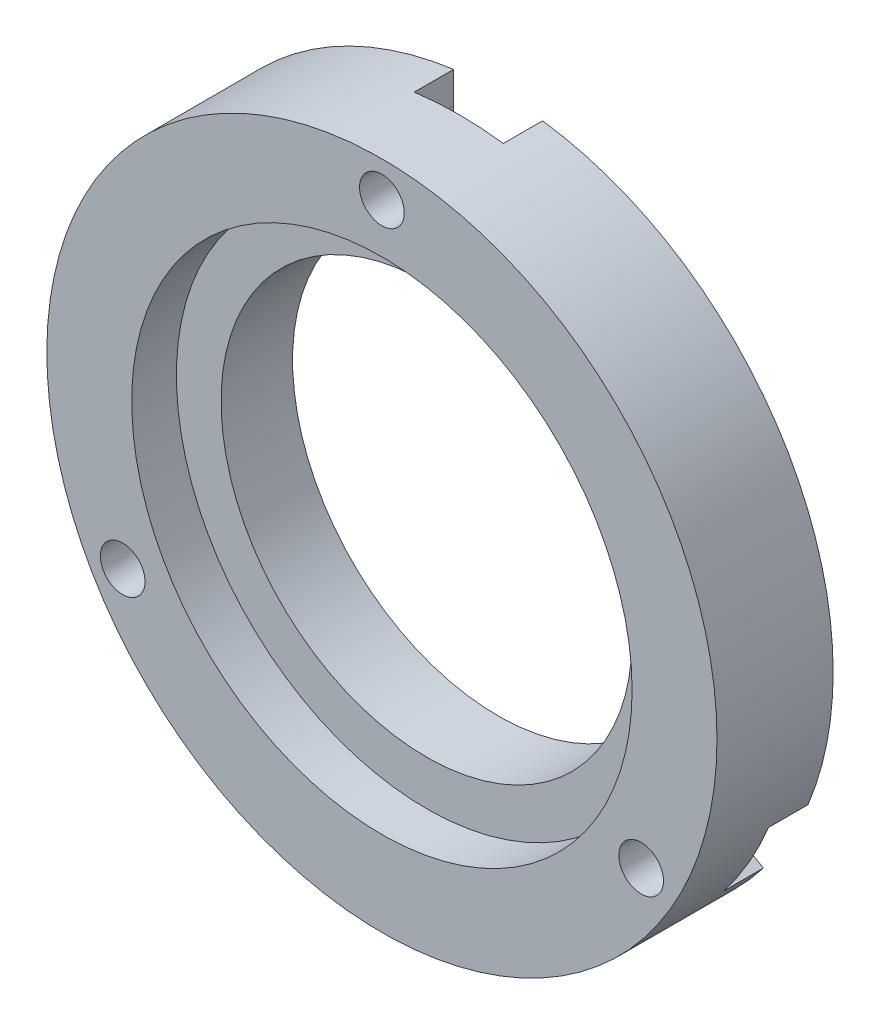
ISO-10303-21;
HEADER;
FILE_DESCRIPTION(('STEP AP214'),'2;1');
FILE_NAME('part.step','',(''),(''),'','','');
FILE_SCHEMA(('AUTOMOTIVE_DESIGN { 1 0 10303 214 1 1 1 1 }'));
ENDSEC;
DATA;
#1=APPLICATION_CONTEXT('core data for automotive mechanical design processes');
#2=APPLICATION_PROTOCOL_DEFINITION('international standard','automotive_design',2000,#1);
#3=PRODUCT_CONTEXT('',#1,'mechanical');
#4=PRODUCT('Part','Part','',(#3));
#5=PRODUCT_RELATED_PRODUCT_CATEGORY('part','',(#4));
#6=PRODUCT_DEFINITION_FORMATION('','',#4);
#7=PRODUCT_DEFINITION_CONTEXT('part definition',#1,'design');
#8=PRODUCT_DEFINITION('design','',#6,#7);
#9=PRODUCT_DEFINITION_SHAPE('','',#8);
#10=(LENGTH_UNIT() NAMED_UNIT(*) SI_UNIT(.MILLI.,.METRE.));
#11=(NAMED_UNIT(*) PLANE_ANGLE_UNIT() SI_UNIT($,.RADIAN.));
#12=(NAMED_UNIT(*) SI_UNIT($,.STERADIAN.) SOLID_ANGLE_UNIT());
#13=UNCERTAINTY_MEASURE_WITH_UNIT(LENGTH_MEASURE(1.E-05),#10,'distance_accuracy_value','');
#14=(GEOMETRIC_REPRESENTATION_CONTEXT(3) GLOBAL_UNCERTAINTY_ASSIGNED_CONTEXT((#13)) GLOBAL_UNIT_ASSIGNED_CONTEXT((#10,
#11,#12)) REPRESENTATION_CONTEXT('',''));
#15=CARTESIAN_POINT('',(0.,0.,0.));
#16=DIRECTION('',(0.,0.,1.));
#17=DIRECTION('',(1.,0.,0.));
#18=AXIS2_PLACEMENT_3D('',#15,#16,#17);
#19=CARTESIAN_POINT('',(14.5059255133883,-8.37500000000063,6.5));
#20=DIRECTION('',(0.,0.,-1.));
#21=DIRECTION('',(-1.,0.,0.));
#22=AXIS2_PLACEMENT_3D('',#19,#20,#21);
#23=CYLINDRICAL_SURFACE('',#22,1.25000000000135);
#24=CARTESIAN_POINT('',(14.5059255133883,-8.37500000000063,6.5));
#25=DIRECTION('',(0.,0.,1.));
#26=DIRECTION('',(1.,0.,0.));
#27=AXIS2_PLACEMENT_3D('',#24,#25,#26);
#28=CIRCLE('',#27,1.25000000000135);
#29=CARTESIAN_POINT('',(15.7559255133896,-8.37500000000063,6.5));
#30=VERTEX_POINT('',#29);
#31=EDGE_CURVE('E51',#30,#30,#28,.T.);
#32=ORIENTED_EDGE('',*,*,#31,.T.);
#33=EDGE_LOOP('',(#32));
#34=FACE_BOUND('',#33,.T.);
#35=CARTESIAN_POINT('',(14.5059255133883,-8.37500000000063,2.2));
#36=DIRECTION('',(0.,0.,-1.));
#37=DIRECTION('',(-1.,0.,0.));
#38=AXIS2_PLACEMENT_3D('',#35,#36,#37);
#39=CIRCLE('',#38,1.25000000000135);
#40=CARTESIAN_POINT('',(13.2559255133869,-8.37500000000063,2.2));
#41=VERTEX_POINT('',#40);
#42=EDGE_CURVE('E174',#41,#41,#39,.T.);
#43=ORIENTED_EDGE('',*,*,#42,.T.);
#44=EDGE_LOOP('',(#43));
#45=FACE_BOUND('',#44,.T.);
#46=ADVANCED_FACE('F41',(#34,#45),#23,.F.);
#47=CARTESIAN_POINT('',(-14.5059255133904,-8.37499999999937,6.5));
#48=DIRECTION('',(0.,0.,-1.));
#49=DIRECTION('',(-1.,0.,0.));
#50=AXIS2_PLACEMENT_3D('',#47,#48,#49);
#51=CYLINDRICAL_SURFACE('',#50,1.25000000000093);
#52=CARTESIAN_POINT('',(-14.5059255133904,-8.37499999999937,6.5));
#53=DIRECTION('',(0.,0.,1.));
#54=DIRECTION('',(1.,0.,0.));
#55=AXIS2_PLACEMENT_3D('',#52,#53,#54);
#56=CIRCLE('',#55,1.25000000000093);
#57=CARTESIAN_POINT('',(-13.2559255133895,-8.37499999999937,6.5));
#58=VERTEX_POINT('',#57);
#59=EDGE_CURVE('E195',#58,#58,#56,.T.);
#60=ORIENTED_EDGE('',*,*,#59,.T.);
#61=EDGE_LOOP('',(#60));
#62=FACE_BOUND('',#61,.T.);
#63=CARTESIAN_POINT('',(-14.5059255133904,-8.37499999999937,2.2));
#64=DIRECTION('',(0.,0.,-1.));
#65=DIRECTION('',(-1.,0.,0.));
#66=AXIS2_PLACEMENT_3D('',#63,#64,#65);
#67=CIRCLE('',#66,1.25000000000093);
#68=CARTESIAN_POINT('',(-15.7559255133914,-8.37499999999937,2.2));
#69=VERTEX_POINT('',#68);
#70=EDGE_CURVE('E179',#69,#69,#67,.T.);
#71=ORIENTED_EDGE('',*,*,#70,.T.);
#72=EDGE_LOOP('',(#71));
#73=FACE_BOUND('',#72,.T.);
#74=ADVANCED_FACE('F329',(#62,#73),#51,.F.);
#75=CARTESIAN_POINT('',(0.,16.75,6.5));
#76=DIRECTION('',(0.,0.,-1.));
#77=DIRECTION('',(-1.,0.,0.));
#78=AXIS2_PLACEMENT_3D('',#75,#76,#77);
#79=CYLINDRICAL_SURFACE('',#78,1.25);
#80=CARTESIAN_POINT('',(0.,16.75,6.5));
#81=DIRECTION('',(0.,0.,1.));
#82=DIRECTION('',(1.,0.,0.));
#83=AXIS2_PLACEMENT_3D('',#80,#81,#82);
#84=CIRCLE('',#83,1.25);
#85=CARTESIAN_POINT('',(1.25,16.75,6.5));
#86=VERTEX_POINT('',#85);
#87=EDGE_CURVE('E191',#86,#86,#84,.T.);
#88=ORIENTED_EDGE('',*,*,#87,.T.);
#89=EDGE_LOOP('',(#88));
#90=FACE_BOUND('',#89,.T.);
#91=CARTESIAN_POINT('',(0.,16.75,2.2));
#92=DIRECTION('',(0.,0.,-1.));
#93=DIRECTION('',(-1.,0.,0.));
#94=AXIS2_PLACEMENT_3D('',#91,#92,#93);
#95=CIRCLE('',#94,1.25);
#96=CARTESIAN_POINT('',(-1.25,16.75,2.2));
#97=VERTEX_POINT('',#96);
#98=EDGE_CURVE('E170',#97,#97,#95,.T.);
#99=ORIENTED_EDGE('',*,*,#98,.T.);
#100=EDGE_LOOP('',(#99));
#101=FACE_BOUND('',#100,.T.);
#102=ADVANCED_FACE('F336',(#90,#101),#79,.F.);
#103=CARTESIAN_POINT('',(0.,0.,6.5));
#104=DIRECTION('',(0.,0.,-1.));
#105=DIRECTION('',(-1.,0.,0.));
#106=AXIS2_PLACEMENT_3D('',#103,#104,#105);
#107=CYLINDRICAL_SURFACE('',#106,11.5);
#108=CARTESIAN_POINT('',(0.,0.,0.));
#109=DIRECTION('',(0.,0.,1.));
#110=DIRECTION('',(1.,0.,0.));
#111=AXIS2_PLACEMENT_3D('',#108,#109,#110);
#112=CIRCLE('',#111,11.5);
#113=CARTESIAN_POINT('',(11.5,0.,0.));
#114=VERTEX_POINT('',#113);
#115=EDGE_CURVE('E203',#114,#114,#112,.T.);
#116=ORIENTED_EDGE('',*,*,#115,.F.);
#117=EDGE_LOOP('',(#116));
#118=FACE_BOUND('',#117,.T.);
#119=CARTESIAN_POINT('',(0.,0.,4.));
#120=DIRECTION('',(0.,0.,1.));
#121=DIRECTION('',(1.,0.,0.));
#122=AXIS2_PLACEMENT_3D('',#119,#120,#121);
#123=CIRCLE('',#122,11.5);
#124=CARTESIAN_POINT('',(11.5,0.,4.));
#125=VERTEX_POINT('',#124);
#126=EDGE_CURVE('E45',#125,#125,#123,.T.);
#127=ORIENTED_EDGE('',*,*,#126,.T.);
#128=EDGE_LOOP('',(#127));
#129=FACE_BOUND('',#128,.T.);
#130=ADVANCED_FACE('F43',(#118,#129),#107,.F.);
#131=CARTESIAN_POINT('',(0.,0.,6.5));
#132=DIRECTION('',(0.,0.,-1.));
#133=DIRECTION('',(-1.,0.,0.));
#134=AXIS2_PLACEMENT_3D('',#131,#132,#133);
#135=CYLINDRICAL_SURFACE('',#134,18.75);
#136=CARTESIAN_POINT('',(0.,0.,0.));
#137=DIRECTION('',(0.,0.,1.));
#138=DIRECTION('',(1.,0.,0.));
#139=AXIS2_PLACEMENT_3D('',#136,#137,#138);
#140=CIRCLE('',#139,18.75);
#141=CARTESIAN_POINT('',(17.3390168270808,-7.13589486120757,0.));
#142=VERTEX_POINT('',#141);
#143=CARTESIAN_POINT('',(2.49151525396037,18.5837254537211,0.));
#144=VERTEX_POINT('',#143);
#145=EDGE_CURVE('E206',#142,#144,#140,.T.);
#146=ORIENTED_EDGE('',*,*,#145,.T.);
#147=DIRECTION('',(0.,0.,-1.));
#148=VECTOR('',#147,1.);
#149=CARTESIAN_POINT('',(2.49151525396037,18.5837254537211,2.2));
#150=LINE('',#149,#148);
#151=CARTESIAN_POINT('',(2.49151525396037,18.5837254537211,2.2));
#152=VERTEX_POINT('',#151);
#153=EDGE_CURVE('E241',#152,#144,#150,.T.);
#154=ORIENTED_EDGE('',*,*,#153,.F.);
#155=CARTESIAN_POINT('',(0.,0.,2.2));
#156=DIRECTION('',(0.,0.,-1.));
#157=DIRECTION('',(-1.,0.,0.));
#158=AXIS2_PLACEMENT_3D('',#155,#156,#157);
#159=CIRCLE('',#158,18.75);
#160=CARTESIAN_POINT('',(-2.48964218499991,18.5839764795016,2.2));
#161=VERTEX_POINT('',#160);
#162=EDGE_CURVE('E158',#161,#152,#159,.T.);
#163=ORIENTED_EDGE('',*,*,#162,.F.);
#164=DIRECTION('',(0.,0.,-1.));
#165=VECTOR('',#164,1.);
#166=CARTESIAN_POINT('',(-2.48964218499991,18.5839764795016,2.2));
#167=LINE('',#166,#165);
#168=CARTESIAN_POINT('',(-2.48964218499991,18.5839764795016,0.));
#169=VERTEX_POINT('',#168);
#170=EDGE_CURVE('E141',#161,#169,#167,.T.);
#171=ORIENTED_EDGE('',*,*,#170,.T.);
#172=CARTESIAN_POINT('',(-17.3397359668583,-7.1341472230143,0.));
#173=VERTEX_POINT('',#172);
#174=EDGE_CURVE('E196',#169,#173,#140,.T.);
#175=ORIENTED_EDGE('',*,*,#174,.T.);
#176=DIRECTION('',(0.,0.,-1.));
#177=VECTOR('',#176,1.);
#178=CARTESIAN_POINT('',(-17.3397359668583,-7.1341472230143,2.2));
#179=LINE('',#178,#177);
#180=CARTESIAN_POINT('',(-17.3397359668583,-7.1341472230143,2.2));
#181=VERTEX_POINT('',#180);
#182=EDGE_CURVE('E222',#181,#173,#179,.T.);
#183=ORIENTED_EDGE('',*,*,#182,.F.);
#184=CARTESIAN_POINT('',(0.,0.,2.2));
#185=DIRECTION('',(0.,0.,-1.));
#186=DIRECTION('',(-1.,0.,0.));
#187=AXIS2_PLACEMENT_3D('',#184,#185,#186);
#188=CIRCLE('',#187,18.75);
#189=CARTESIAN_POINT('',(-14.849374642081,-11.448081618294,2.2));
#190=VERTEX_POINT('',#189);
#191=EDGE_CURVE('E294',#190,#181,#188,.T.);
#192=ORIENTED_EDGE('',*,*,#191,.F.);
#193=DIRECTION('',(0.,0.,-1.));
#194=VECTOR('',#193,1.);
#195=CARTESIAN_POINT('',(-14.849374642081,-11.448081618294,2.2));
#196=LINE('',#195,#194);
#197=CARTESIAN_POINT('',(-14.849374642081,-11.448081618294,0.));
#198=VERTEX_POINT('',#197);
#199=EDGE_CURVE('E265',#190,#198,#196,.T.);
#200=ORIENTED_EDGE('',*,*,#199,.T.);
#201=CARTESIAN_POINT('',(14.8482207128978,-11.4495782307068,0.));
#202=VERTEX_POINT('',#201);
#203=EDGE_CURVE('E209',#198,#202,#140,.T.);
#204=ORIENTED_EDGE('',*,*,#203,.T.);
#205=DIRECTION('',(0.,0.,-1.));
#206=VECTOR('',#205,1.);
#207=CARTESIAN_POINT('',(14.8482207128978,-11.4495782307068,2.2));
#208=LINE('',#207,#206);
#209=CARTESIAN_POINT('',(14.8482207128978,-11.4495782307068,2.2));
#210=VERTEX_POINT('',#209);
#211=EDGE_CURVE('E286',#210,#202,#208,.T.);
#212=ORIENTED_EDGE('',*,*,#211,.F.);
#213=CARTESIAN_POINT('',(0.,0.,2.2));
#214=DIRECTION('',(0.,0.,-1.));
#215=DIRECTION('',(-1.,0.,0.));
#216=AXIS2_PLACEMENT_3D('',#213,#214,#215);
#217=CIRCLE('',#216,18.75);
#218=CARTESIAN_POINT('',(17.3390168270808,-7.13589486120757,2.2));
#219=VERTEX_POINT('',#218);
#220=EDGE_CURVE('E163',#219,#210,#217,.T.);
#221=ORIENTED_EDGE('',*,*,#220,.F.);
#222=DIRECTION('',(0.,0.,-1.));
#223=VECTOR('',#222,1.);
#224=CARTESIAN_POINT('',(17.3390168270808,-7.13589486120757,2.2));
#225=LINE('',#224,#223);
#226=EDGE_CURVE('E266',#219,#142,#225,.T.);
#227=ORIENTED_EDGE('',*,*,#226,.T.);
#228=EDGE_LOOP('',(#146,#154,#163,#171,#175,#183,#192,#200,#204,#212,#221,#227));
#229=FACE_BOUND('',#228,.T.);
#230=CARTESIAN_POINT('',(0.,0.,6.5));
#231=DIRECTION('',(0.,0.,1.));
#232=DIRECTION('',(1.,0.,0.));
#233=AXIS2_PLACEMENT_3D('',#230,#231,#232);
#234=CIRCLE('',#233,18.75);
#235=CARTESIAN_POINT('',(18.75,0.,6.5));
#236=VERTEX_POINT('',#235);
#237=EDGE_CURVE('E12',#236,#236,#234,.T.);
#238=ORIENTED_EDGE('',*,*,#237,.F.);
#239=EDGE_LOOP('',(#238));
#240=FACE_BOUND('',#239,.T.);
#241=ADVANCED_FACE('F220',(#229,#240),#135,.T.);
#242=CARTESIAN_POINT('',(0.,0.,6.5));
#243=DIRECTION('',(0.,0.,1.));
#244=DIRECTION('',(1.,0.,0.));
#245=AXIS2_PLACEMENT_3D('',#242,#243,#244);
#246=PLANE('',#245);
#247=CARTESIAN_POINT('',(0.,0.,6.5));
#248=DIRECTION('',(0.,0.,1.));
#249=DIRECTION('',(1.,0.,0.));
#250=AXIS2_PLACEMENT_3D('',#247,#248,#249);
#251=CIRCLE('',#250,14.);
#252=CARTESIAN_POINT('',(14.,0.,6.5));
#253=VERTEX_POINT('',#252);
#254=EDGE_CURVE('E183',#253,#253,#251,.T.);
#255=ORIENTED_EDGE('',*,*,#254,.F.);
#256=EDGE_LOOP('',(#255));
#257=FACE_BOUND('',#256,.T.);
#258=ORIENTED_EDGE('',*,*,#87,.F.);
#259=EDGE_LOOP('',(#258));
#260=FACE_BOUND('',#259,.T.);
#261=ORIENTED_EDGE('',*,*,#59,.F.);
#262=EDGE_LOOP('',(#261));
#263=FACE_BOUND('',#262,.T.);
#264=ORIENTED_EDGE('',*,*,#31,.F.);
#265=EDGE_LOOP('',(#264));
#266=FACE_BOUND('',#265,.T.);
#267=ORIENTED_EDGE('',*,*,#237,.T.);
#268=EDGE_LOOP('',(#267));
#269=FACE_BOUND('',#268,.T.);
#270=ADVANCED_FACE('F371',(#257,#260,#263,#266,#269),#246,.T.);
#271=CARTESIAN_POINT('',(0.,0.,0.));
#272=DIRECTION('',(0.,0.,1.));
#273=DIRECTION('',(1.,0.,0.));
#274=AXIS2_PLACEMENT_3D('',#271,#272,#273);
#275=PLANE('',#274);
#276=ORIENTED_EDGE('',*,*,#115,.T.);
#277=EDGE_LOOP('',(#276));
#278=FACE_BOUND('',#277,.T.);
#279=CARTESIAN_POINT('',(9.27209697909603E-13,16.7500000000006,0.));
#280=DIRECTION('',(0.,0.,-1.));
#281=DIRECTION('',(-1.,0.,0.));
#282=AXIS2_PLACEMENT_3D('',#279,#280,#281);
#283=CIRCLE('',#282,2.5);
#284=CARTESIAN_POINT('',(2.49851367155371,16.8361941591057,0.));
#285=VERTEX_POINT('',#284);
#286=CARTESIAN_POINT('',(-2.4991238908121,16.8161798939832,0.));
#287=VERTEX_POINT('',#286);
#288=EDGE_CURVE('E152',#285,#287,#283,.T.);
#289=ORIENTED_EDGE('',*,*,#288,.F.);
#290=DIRECTION('',(0.00400471310317549,-0.999991981104329,0.));
#291=VECTOR('',#290,1.);
#292=CARTESIAN_POINT('',(2.56589718776298,0.0102757644895189,0.));
#293=LINE('',#292,#291);
#294=EDGE_CURVE('E252',#144,#285,#293,.T.);
#295=ORIENTED_EDGE('',*,*,#294,.F.);
#296=ORIENTED_EDGE('',*,*,#145,.F.);
#297=DIRECTION('',(0.863331199318094,-0.504637731728396,0.));
#298=VECTOR('',#297,1.);
#299=CARTESIAN_POINT('',(1.30664911939185,2.23540746243613,0.));
#300=LINE('',#299,#298);
#301=CARTESIAN_POINT('',(15.8128009282046,-6.24378517034379,0.));
#302=VERTEX_POINT('',#301);
#303=EDGE_CURVE('E262',#302,#142,#300,.T.);
#304=ORIENTED_EDGE('',*,*,#303,.F.);
#305=CARTESIAN_POINT('',(14.5059255133894,-8.37500000000118,0.));
#306=DIRECTION('',(0.,0.,-1.));
#307=DIRECTION('',(-1.,0.,0.));
#308=AXIS2_PLACEMENT_3D('',#305,#306,#307);
#309=CIRCLE('',#308,2.5);
#310=CARTESIAN_POINT('',(13.3313150090558,-10.5818733908212,0.));
#311=VERTEX_POINT('',#310);
#312=EDGE_CURVE('E157',#311,#302,#309,.T.);
#313=ORIENTED_EDGE('',*,*,#312,.F.);
#314=DIRECTION('',(-0.868020815768663,0.49652780726995,0.));
#315=VECTOR('',#314,1.);
#316=CARTESIAN_POINT('',(-1.27404952079027,-2.22727003034654,0.));
#317=LINE('',#316,#315);
#318=EDGE_CURVE('E269',#202,#311,#317,.T.);
#319=ORIENTED_EDGE('',*,*,#318,.F.);
#320=ORIENTED_EDGE('',*,*,#203,.F.);
#321=DIRECTION('',(-0.868694695043998,-0.495347884624953,0.));
#322=VECTOR('',#321,1.);
#323=CARTESIAN_POINT('',(1.28259509058306,-2.24929506244399,0.));
#324=LINE('',#323,#322);
#325=CARTESIAN_POINT('',(-13.3136770373926,-10.5723947236394,0.));
#326=VERTEX_POINT('',#325);
#327=EDGE_CURVE('E247',#326,#198,#324,.T.);
#328=ORIENTED_EDGE('',*,*,#327,.F.);
#329=CARTESIAN_POINT('',(-14.5059255133904,-8.37499999999937,0.));
#330=DIRECTION('',(0.,0.,-1.));
#331=DIRECTION('',(-1.,0.,0.));
#332=AXIS2_PLACEMENT_3D('',#329,#330,#331);
#333=CIRCLE('',#332,2.5);
#334=CARTESIAN_POINT('',(-15.8298286806096,-6.25432076828444,0.));
#335=VERTEX_POINT('',#334);
#336=EDGE_CURVE('E230',#335,#326,#333,.T.);
#337=ORIENTED_EDGE('',*,*,#336,.F.);
#338=DIRECTION('',(0.864016102665493,0.503464173834377,0.));
#339=VECTOR('',#338,1.);
#340=CARTESIAN_POINT('',(-1.29184766697273,2.21699426585708,0.));
#341=LINE('',#340,#339);
#342=EDGE_CURVE('E227',#173,#335,#341,.T.);
#343=ORIENTED_EDGE('',*,*,#342,.F.);
#344=ORIENTED_EDGE('',*,*,#174,.F.);
#345=DIRECTION('',(0.00536349572589624,0.999985616353354,0.));
#346=VECTOR('',#345,1.);
#347=CARTESIAN_POINT('',(-2.58924420997492,0.0138876000078334,0.));
#348=LINE('',#347,#346);
#349=EDGE_CURVE('E143',#287,#169,#348,.T.);
#350=ORIENTED_EDGE('',*,*,#349,.F.);
#351=EDGE_LOOP('',(#289,#295,#296,#304,#313,#319,#320,#328,#337,#343,#344,#350));
#352=FACE_BOUND('',#351,.T.);
#353=ADVANCED_FACE('F225',(#278,#352),#275,.F.);
#354=CARTESIAN_POINT('',(0.,0.,4.));
#355=DIRECTION('',(0.,0.,1.));
#356=DIRECTION('',(1.,0.,0.));
#357=AXIS2_PLACEMENT_3D('',#354,#355,#356);
#358=CYLINDRICAL_SURFACE('',#357,14.);
#359=CARTESIAN_POINT('',(0.,0.,4.));
#360=DIRECTION('',(0.,0.,1.));
#361=DIRECTION('',(1.,0.,0.));
#362=AXIS2_PLACEMENT_3D('',#359,#360,#361);
#363=CIRCLE('',#362,14.);
#364=CARTESIAN_POINT('',(14.,0.,4.));
#365=VERTEX_POINT('',#364);
#366=EDGE_CURVE('E184',#365,#365,#363,.T.);
#367=ORIENTED_EDGE('',*,*,#366,.F.);
#368=EDGE_LOOP('',(#367));
#369=FACE_BOUND('',#368,.T.);
#370=ORIENTED_EDGE('',*,*,#254,.T.);
#371=EDGE_LOOP('',(#370));
#372=FACE_BOUND('',#371,.T.);
#373=ADVANCED_FACE('F366',(#369,#372),#358,.F.);
#374=CARTESIAN_POINT('',(0.,0.,4.));
#375=DIRECTION('',(0.,0.,1.));
#376=DIRECTION('',(1.,0.,0.));
#377=AXIS2_PLACEMENT_3D('',#374,#375,#376);
#378=PLANE('',#377);
#379=ORIENTED_EDGE('',*,*,#126,.F.);
#380=EDGE_LOOP('',(#379));
#381=FACE_BOUND('',#380,.T.);
#382=ORIENTED_EDGE('',*,*,#366,.T.);
#383=EDGE_LOOP('',(#382));
#384=FACE_BOUND('',#383,.T.);
#385=ADVANCED_FACE('F360',(#381,#384),#378,.T.);
#386=CARTESIAN_POINT('',(9.27209697909603E-13,16.7500000000006,2.2));
#387=DIRECTION('',(0.,0.,-1.));
#388=DIRECTION('',(-1.,0.,0.));
#389=AXIS2_PLACEMENT_3D('',#386,#387,#388);
#390=CYLINDRICAL_SURFACE('',#389,2.5);
#391=CARTESIAN_POINT('',(9.27209697909603E-13,16.7500000000006,2.2));
#392=DIRECTION('',(0.,0.,-1.));
#393=DIRECTION('',(-1.,0.,0.));
#394=AXIS2_PLACEMENT_3D('',#391,#392,#393);
#395=CIRCLE('',#394,2.5);
#396=CARTESIAN_POINT('',(2.49851367155371,16.8361941591057,2.2));
#397=VERTEX_POINT('',#396);
#398=CARTESIAN_POINT('',(-2.4991238908121,16.8161798939832,2.2));
#399=VERTEX_POINT('',#398);
#400=EDGE_CURVE('E150',#397,#399,#395,.T.);
#401=ORIENTED_EDGE('',*,*,#400,.F.);
#402=DIRECTION('',(0.,0.,-1.));
#403=VECTOR('',#402,1.);
#404=CARTESIAN_POINT('',(2.49851367155371,16.8361941591057,2.2));
#405=LINE('',#404,#403);
#406=EDGE_CURVE('E236',#397,#285,#405,.T.);
#407=ORIENTED_EDGE('',*,*,#406,.T.);
#408=ORIENTED_EDGE('',*,*,#288,.T.);
#409=DIRECTION('',(0.,0.,-1.));
#410=VECTOR('',#409,1.);
#411=CARTESIAN_POINT('',(-2.4991238908121,16.8161798939832,2.2));
#412=LINE('',#411,#410);
#413=EDGE_CURVE('E138',#399,#287,#412,.T.);
#414=ORIENTED_EDGE('',*,*,#413,.F.);
#415=EDGE_LOOP('',(#401,#407,#408,#414));
#416=FACE_BOUND('',#415,.T.);
#417=ADVANCED_FACE('F148',(#416),#390,.F.);
#418=CARTESIAN_POINT('',(4.63604848954802E-13,8.37500000000031,2.2));
#419=DIRECTION('',(0.,0.,-1.));
#420=DIRECTION('',(-1.,0.,0.));
#421=AXIS2_PLACEMENT_3D('',#418,#419,#420);
#422=PLANE('',#421);
#423=ORIENTED_EDGE('',*,*,#98,.F.);
#424=EDGE_LOOP('',(#423));
#425=FACE_BOUND('',#424,.T.);
#426=ORIENTED_EDGE('',*,*,#162,.T.);
#427=DIRECTION('',(0.00400471310317549,-0.999991981104329,0.));
#428=VECTOR('',#427,1.);
#429=CARTESIAN_POINT('',(2.56589718776298,0.0102757644895189,2.2));
#430=LINE('',#429,#428);
#431=EDGE_CURVE('E59',#152,#397,#430,.T.);
#432=ORIENTED_EDGE('',*,*,#431,.T.);
#433=ORIENTED_EDGE('',*,*,#400,.T.);
#434=DIRECTION('',(0.00536349572589624,0.999985616353354,0.));
#435=VECTOR('',#434,1.);
#436=CARTESIAN_POINT('',(-2.58924420997492,0.0138876000078334,2.2));
#437=LINE('',#436,#435);
#438=EDGE_CURVE('E135',#399,#161,#437,.T.);
#439=ORIENTED_EDGE('',*,*,#438,.T.);
#440=EDGE_LOOP('',(#426,#432,#433,#439));
#441=FACE_BOUND('',#440,.T.);
#442=ADVANCED_FACE('F155',(#425,#441),#422,.T.);
#443=CARTESIAN_POINT('',(14.5059255133894,-8.37500000000118,2.2));
#444=DIRECTION('',(0.,0.,-1.));
#445=DIRECTION('',(-1.,0.,0.));
#446=AXIS2_PLACEMENT_3D('',#443,#444,#445);
#447=CYLINDRICAL_SURFACE('',#446,2.5);
#448=ORIENTED_EDGE('',*,*,#312,.T.);
#449=DIRECTION('',(0.,0.,-1.));
#450=VECTOR('',#449,1.);
#451=CARTESIAN_POINT('',(15.8128009282046,-6.24378517034379,2.2));
#452=LINE('',#451,#450);
#453=CARTESIAN_POINT('',(15.8128009282046,-6.24378517034379,2.2));
#454=VERTEX_POINT('',#453);
#455=EDGE_CURVE('E261',#454,#302,#452,.T.);
#456=ORIENTED_EDGE('',*,*,#455,.F.);
#457=CARTESIAN_POINT('',(14.5059255133894,-8.37500000000118,2.2));
#458=DIRECTION('',(0.,0.,-1.));
#459=DIRECTION('',(-1.,0.,0.));
#460=AXIS2_PLACEMENT_3D('',#457,#458,#459);
#461=CIRCLE('',#460,2.5);
#462=CARTESIAN_POINT('',(13.3313150090559,-10.5818733908212,2.2));
#463=VERTEX_POINT('',#462);
#464=EDGE_CURVE('E302',#463,#454,#461,.T.);
#465=ORIENTED_EDGE('',*,*,#464,.F.);
#466=DIRECTION('',(0.,0.,-1.));
#467=VECTOR('',#466,1.);
#468=CARTESIAN_POINT('',(13.3313150090558,-10.5818733908212,2.2));
#469=LINE('',#468,#467);
#470=EDGE_CURVE('E169',#463,#311,#469,.T.);
#471=ORIENTED_EDGE('',*,*,#470,.T.);
#472=EDGE_LOOP('',(#448,#456,#465,#471));
#473=FACE_BOUND('',#472,.T.);
#474=ADVANCED_FACE('F310',(#473),#447,.F.);
#475=CARTESIAN_POINT('',(7.25296275669469,-4.18750000000059,2.2));
#476=DIRECTION('',(0.,0.,-1.));
#477=DIRECTION('',(-1.,0.,0.));
#478=AXIS2_PLACEMENT_3D('',#475,#476,#477);
#479=PLANE('',#478);
#480=ORIENTED_EDGE('',*,*,#42,.F.);
#481=EDGE_LOOP('',(#480));
#482=FACE_BOUND('',#481,.T.);
#483=ORIENTED_EDGE('',*,*,#220,.T.);
#484=DIRECTION('',(-0.868020815768663,0.49652780726995,0.));
#485=VECTOR('',#484,1.);
#486=CARTESIAN_POINT('',(-1.27404952079027,-2.22727003034654,2.2));
#487=LINE('',#486,#485);
#488=EDGE_CURVE('E67',#210,#463,#487,.T.);
#489=ORIENTED_EDGE('',*,*,#488,.T.);
#490=ORIENTED_EDGE('',*,*,#464,.T.);
#491=DIRECTION('',(0.863331199318094,-0.504637731728396,0.));
#492=VECTOR('',#491,1.);
#493=CARTESIAN_POINT('',(1.30664911939185,2.23540746243613,2.2));
#494=LINE('',#493,#492);
#495=EDGE_CURVE('E257',#454,#219,#494,.T.);
#496=ORIENTED_EDGE('',*,*,#495,.T.);
#497=EDGE_LOOP('',(#483,#489,#490,#496));
#498=FACE_BOUND('',#497,.T.);
#499=ADVANCED_FACE('F307',(#482,#498),#479,.T.);
#500=CARTESIAN_POINT('',(-14.5059255133904,-8.37499999999937,2.2));
#501=DIRECTION('',(0.,0.,-1.));
#502=DIRECTION('',(-1.,0.,0.));
#503=AXIS2_PLACEMENT_3D('',#500,#501,#502);
#504=CYLINDRICAL_SURFACE('',#503,2.5);
#505=CARTESIAN_POINT('',(-14.5059255133904,-8.37499999999937,2.2));
#506=DIRECTION('',(0.,0.,-1.));
#507=DIRECTION('',(-1.,0.,0.));
#508=AXIS2_PLACEMENT_3D('',#505,#506,#507);
#509=CIRCLE('',#508,2.5);
#510=CARTESIAN_POINT('',(-15.8298286806096,-6.25432076828445,2.2));
#511=VERTEX_POINT('',#510);
#512=CARTESIAN_POINT('',(-13.3136770373926,-10.5723947236394,2.2));
#513=VERTEX_POINT('',#512);
#514=EDGE_CURVE('E175',#511,#513,#509,.T.);
#515=ORIENTED_EDGE('',*,*,#514,.F.);
#516=DIRECTION('',(0.,0.,-1.));
#517=VECTOR('',#516,1.);
#518=CARTESIAN_POINT('',(-15.8298286806096,-6.25432076828444,2.2));
#519=LINE('',#518,#517);
#520=EDGE_CURVE('E244',#511,#335,#519,.T.);
#521=ORIENTED_EDGE('',*,*,#520,.T.);
#522=ORIENTED_EDGE('',*,*,#336,.T.);
#523=DIRECTION('',(0.,0.,-1.));
#524=VECTOR('',#523,1.);
#525=CARTESIAN_POINT('',(-13.3136770373926,-10.5723947236394,2.2));
#526=LINE('',#525,#524);
#527=EDGE_CURVE('E276',#513,#326,#526,.T.);
#528=ORIENTED_EDGE('',*,*,#527,.F.);
#529=EDGE_LOOP('',(#515,#521,#522,#528));
#530=FACE_BOUND('',#529,.T.);
#531=ADVANCED_FACE('F456',(#530),#504,.F.);
#532=CARTESIAN_POINT('',(-7.25296275669521,-4.18749999999969,2.2));
#533=DIRECTION('',(0.,0.,-1.));
#534=DIRECTION('',(-1.,0.,0.));
#535=AXIS2_PLACEMENT_3D('',#532,#533,#534);
#536=PLANE('',#535);
#537=ORIENTED_EDGE('',*,*,#70,.F.);
#538=EDGE_LOOP('',(#537));
#539=FACE_BOUND('',#538,.T.);
#540=ORIENTED_EDGE('',*,*,#191,.T.);
#541=DIRECTION('',(0.864016102665493,0.503464173834377,0.));
#542=VECTOR('',#541,1.);
#543=CARTESIAN_POINT('',(-1.29184766697273,2.21699426585708,2.2));
#544=LINE('',#543,#542);
#545=EDGE_CURVE('E235',#181,#511,#544,.T.);
#546=ORIENTED_EDGE('',*,*,#545,.T.);
#547=ORIENTED_EDGE('',*,*,#514,.T.);
#548=DIRECTION('',(-0.868694695043998,-0.495347884624953,0.));
#549=VECTOR('',#548,1.);
#550=CARTESIAN_POINT('',(1.28259509058306,-2.24929506244399,2.2));
#551=LINE('',#550,#549);
#552=EDGE_CURVE('E272',#513,#190,#551,.T.);
#553=ORIENTED_EDGE('',*,*,#552,.T.);
#554=EDGE_LOOP('',(#540,#546,#547,#553));
#555=FACE_BOUND('',#554,.T.);
#556=ADVANCED_FACE('F466',(#539,#555),#536,.T.);
#557=CARTESIAN_POINT('',(1.28259509058306,-2.24929506244399,2.2));
#558=DIRECTION('',(0.495347884624953,-0.868694695043998,0.));
#559=DIRECTION('',(0.868694695043998,0.495347884624953,0.));
#560=AXIS2_PLACEMENT_3D('',#557,#558,#559);
#561=PLANE('',#560);
#562=ORIENTED_EDGE('',*,*,#327,.T.);
#563=ORIENTED_EDGE('',*,*,#199,.F.);
#564=ORIENTED_EDGE('',*,*,#552,.F.);
#565=ORIENTED_EDGE('',*,*,#527,.T.);
#566=EDGE_LOOP('',(#562,#563,#564,#565));
#567=FACE_BOUND('',#566,.T.);
#568=ADVANCED_FACE('F475',(#567),#561,.F.);
#569=CARTESIAN_POINT('',(-1.29184766697273,2.21699426585708,2.2));
#570=DIRECTION('',(-0.503464173834377,0.864016102665493,0.));
#571=DIRECTION('',(-0.864016102665493,-0.503464173834377,0.));
#572=AXIS2_PLACEMENT_3D('',#569,#570,#571);
#573=PLANE('',#572);
#574=ORIENTED_EDGE('',*,*,#342,.T.);
#575=ORIENTED_EDGE('',*,*,#520,.F.);
#576=ORIENTED_EDGE('',*,*,#545,.F.);
#577=ORIENTED_EDGE('',*,*,#182,.T.);
#578=EDGE_LOOP('',(#574,#575,#576,#577));
#579=FACE_BOUND('',#578,.T.);
#580=ADVANCED_FACE('F485',(#579),#573,.F.);
#581=CARTESIAN_POINT('',(-1.27404952079027,-2.22727003034654,2.2));
#582=DIRECTION('',(-0.49652780726995,-0.868020815768663,0.));
#583=DIRECTION('',(0.868020815768663,-0.49652780726995,0.));
#584=AXIS2_PLACEMENT_3D('',#581,#582,#583);
#585=PLANE('',#584);
#586=ORIENTED_EDGE('',*,*,#318,.T.);
#587=ORIENTED_EDGE('',*,*,#470,.F.);
#588=ORIENTED_EDGE('',*,*,#488,.F.);
#589=ORIENTED_EDGE('',*,*,#211,.T.);
#590=EDGE_LOOP('',(#586,#587,#588,#589));
#591=FACE_BOUND('',#590,.T.);
#592=ADVANCED_FACE('F495',(#591),#585,.F.);
#593=CARTESIAN_POINT('',(1.30664911939185,2.23540746243613,2.2));
#594=DIRECTION('',(0.504637731728396,0.863331199318094,0.));
#595=DIRECTION('',(-0.863331199318095,0.504637731728396,0.));
#596=AXIS2_PLACEMENT_3D('',#593,#594,#595);
#597=PLANE('',#596);
#598=ORIENTED_EDGE('',*,*,#303,.T.);
#599=ORIENTED_EDGE('',*,*,#226,.F.);
#600=ORIENTED_EDGE('',*,*,#495,.F.);
#601=ORIENTED_EDGE('',*,*,#455,.T.);
#602=EDGE_LOOP('',(#598,#599,#600,#601));
#603=FACE_BOUND('',#602,.T.);
#604=ADVANCED_FACE('F314',(#603),#597,.F.);
#605=CARTESIAN_POINT('',(-2.58924420997492,0.0138876000078334,2.2));
#606=DIRECTION('',(-0.999985616353354,0.00536349572589624,0.));
#607=DIRECTION('',(-0.00536349572589624,-0.999985616353354,0.));
#608=AXIS2_PLACEMENT_3D('',#605,#606,#607);
#609=PLANE('',#608);
#610=ORIENTED_EDGE('',*,*,#349,.T.);
#611=ORIENTED_EDGE('',*,*,#170,.F.);
#612=ORIENTED_EDGE('',*,*,#438,.F.);
#613=ORIENTED_EDGE('',*,*,#413,.T.);
#614=EDGE_LOOP('',(#610,#611,#612,#613));
#615=FACE_BOUND('',#614,.T.);
#616=ADVANCED_FACE('F137',(#615),#609,.F.);
#617=CARTESIAN_POINT('',(2.56589718776298,0.0102757644895189,2.2));
#618=DIRECTION('',(0.999991981104329,0.00400471310317549,0.));
#619=DIRECTION('',(-0.00400471310317549,0.999991981104329,0.));
#620=AXIS2_PLACEMENT_3D('',#617,#618,#619);
#621=PLANE('',#620);
#622=ORIENTED_EDGE('',*,*,#294,.T.);
#623=ORIENTED_EDGE('',*,*,#406,.F.);
#624=ORIENTED_EDGE('',*,*,#431,.F.);
#625=ORIENTED_EDGE('',*,*,#153,.T.);
#626=EDGE_LOOP('',(#622,#623,#624,#625));
#627=FACE_BOUND('',#626,.T.);
#628=ADVANCED_FACE('F319',(#627),#621,.F.);
#629=CLOSED_SHELL('',(#46,#74,#102,#130,#241,#270,#353,#373,#385,#417,#442,#474,#499,#531,#556,
#568,#580,#592,#604,#616,#628));
#630=MANIFOLD_SOLID_BREP('B2',#629);
#631=ADVANCED_BREP_SHAPE_REPRESENTATION('',(#18,#630),#14);
#632=SHAPE_DEFINITION_REPRESENTATION(#9,#631);
ENDSEC;
END-ISO-10303-21;
